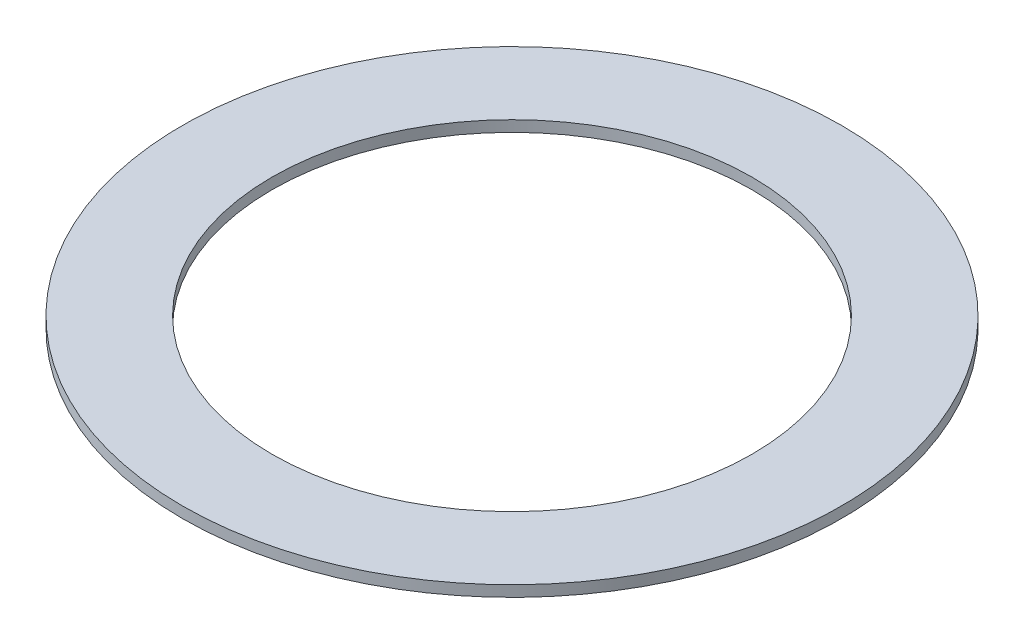
ISO-10303-21;
HEADER;
FILE_DESCRIPTION(('STEP AP214'),'2;1');
FILE_NAME('part.step','',(''),(''),'','','');
FILE_SCHEMA(('AUTOMOTIVE_DESIGN { 1 0 10303 214 1 1 1 1 }'));
ENDSEC;
DATA;
#1=APPLICATION_CONTEXT('core data for automotive mechanical design processes');
#2=APPLICATION_PROTOCOL_DEFINITION('international standard','automotive_design',2000,#1);
#3=PRODUCT_CONTEXT('',#1,'mechanical');
#4=PRODUCT('Part','Part','',(#3));
#5=PRODUCT_RELATED_PRODUCT_CATEGORY('part','',(#4));
#6=PRODUCT_DEFINITION_FORMATION('','',#4);
#7=PRODUCT_DEFINITION_CONTEXT('part definition',#1,'design');
#8=PRODUCT_DEFINITION('design','',#6,#7);
#9=PRODUCT_DEFINITION_SHAPE('','',#8);
#10=(LENGTH_UNIT() NAMED_UNIT(*) SI_UNIT(.MILLI.,.METRE.));
#11=(NAMED_UNIT(*) PLANE_ANGLE_UNIT() SI_UNIT($,.RADIAN.));
#12=(NAMED_UNIT(*) SI_UNIT($,.STERADIAN.) SOLID_ANGLE_UNIT());
#13=UNCERTAINTY_MEASURE_WITH_UNIT(LENGTH_MEASURE(1.E-05),#10,'distance_accuracy_value','');
#14=(GEOMETRIC_REPRESENTATION_CONTEXT(3) GLOBAL_UNCERTAINTY_ASSIGNED_CONTEXT((#13)) GLOBAL_UNIT_ASSIGNED_CONTEXT((#10,
#11,#12)) REPRESENTATION_CONTEXT('',''));
#15=CARTESIAN_POINT('',(0.,0.,0.));
#16=DIRECTION('',(0.,0.,1.));
#17=DIRECTION('',(1.,0.,0.));
#18=AXIS2_PLACEMENT_3D('',#15,#16,#17);
#19=CARTESIAN_POINT('',(0.,1.,0.));
#20=DIRECTION('',(0.,1.,0.));
#21=DIRECTION('',(0.,0.,1.));
#22=AXIS2_PLACEMENT_3D('',#19,#20,#21);
#23=PLANE('',#22);
#24=CARTESIAN_POINT('',(0.,1.,0.));
#25=DIRECTION('',(0.,1.,0.));
#26=DIRECTION('',(0.,0.,1.));
#27=AXIS2_PLACEMENT_3D('',#24,#25,#26);
#28=CIRCLE('',#27,30.);
#29=CARTESIAN_POINT('',(0.,1.,30.));
#30=VERTEX_POINT('',#29);
#31=EDGE_CURVE('E10',#30,#30,#28,.T.);
#32=ORIENTED_EDGE('',*,*,#31,.T.);
#33=EDGE_LOOP('',(#32));
#34=FACE_BOUND('',#33,.T.);
#35=CARTESIAN_POINT('',(0.,1.,0.));
#36=DIRECTION('',(0.,1.,0.));
#37=DIRECTION('',(0.,0.,1.));
#38=AXIS2_PLACEMENT_3D('',#35,#36,#37);
#39=CIRCLE('',#38,21.85);
#40=CARTESIAN_POINT('',(0.,1.,21.85));
#41=VERTEX_POINT('',#40);
#42=EDGE_CURVE('E50',#41,#41,#39,.T.);
#43=ORIENTED_EDGE('',*,*,#42,.F.);
#44=EDGE_LOOP('',(#43));
#45=FACE_BOUND('',#44,.T.);
#46=ADVANCED_FACE('F37',(#34,#45),#23,.T.);
#47=CARTESIAN_POINT('',(0.,0.,0.));
#48=DIRECTION('',(0.,1.,0.));
#49=DIRECTION('',(0.,0.,1.));
#50=AXIS2_PLACEMENT_3D('',#47,#48,#49);
#51=PLANE('',#50);
#52=CARTESIAN_POINT('',(0.,0.,0.));
#53=DIRECTION('',(0.,1.,0.));
#54=DIRECTION('',(0.,0.,1.));
#55=AXIS2_PLACEMENT_3D('',#52,#53,#54);
#56=CIRCLE('',#55,30.);
#57=CARTESIAN_POINT('',(0.,0.,30.));
#58=VERTEX_POINT('',#57);
#59=EDGE_CURVE('E41',#58,#58,#56,.T.);
#60=ORIENTED_EDGE('',*,*,#59,.F.);
#61=EDGE_LOOP('',(#60));
#62=FACE_BOUND('',#61,.T.);
#63=CARTESIAN_POINT('',(0.,0.,0.));
#64=DIRECTION('',(0.,1.,0.));
#65=DIRECTION('',(0.,0.,1.));
#66=AXIS2_PLACEMENT_3D('',#63,#64,#65);
#67=CIRCLE('',#66,21.85);
#68=CARTESIAN_POINT('',(0.,0.,21.85));
#69=VERTEX_POINT('',#68);
#70=EDGE_CURVE('E52',#69,#69,#67,.T.);
#71=ORIENTED_EDGE('',*,*,#70,.T.);
#72=EDGE_LOOP('',(#71));
#73=FACE_BOUND('',#72,.T.);
#74=ADVANCED_FACE('F64',(#62,#73),#51,.F.);
#75=CARTESIAN_POINT('',(0.,1.,0.));
#76=DIRECTION('',(0.,-1.,0.));
#77=DIRECTION('',(0.,0.,-1.));
#78=AXIS2_PLACEMENT_3D('',#75,#76,#77);
#79=CYLINDRICAL_SURFACE('',#78,30.);
#80=ORIENTED_EDGE('',*,*,#31,.F.);
#81=EDGE_LOOP('',(#80));
#82=FACE_BOUND('',#81,.T.);
#83=ORIENTED_EDGE('',*,*,#59,.T.);
#84=EDGE_LOOP('',(#83));
#85=FACE_BOUND('',#84,.T.);
#86=ADVANCED_FACE('F39',(#82,#85),#79,.T.);
#87=CARTESIAN_POINT('',(0.,1.,0.));
#88=DIRECTION('',(0.,-1.,0.));
#89=DIRECTION('',(0.,0.,-1.));
#90=AXIS2_PLACEMENT_3D('',#87,#88,#89);
#91=CYLINDRICAL_SURFACE('',#90,21.85);
#92=ORIENTED_EDGE('',*,*,#42,.T.);
#93=EDGE_LOOP('',(#92));
#94=FACE_BOUND('',#93,.T.);
#95=ORIENTED_EDGE('',*,*,#70,.F.);
#96=EDGE_LOOP('',(#95));
#97=FACE_BOUND('',#96,.T.);
#98=ADVANCED_FACE('F60',(#94,#97),#91,.F.);
#99=CLOSED_SHELL('',(#46,#74,#86,#98));
#100=MANIFOLD_SOLID_BREP('B2',#99);
#101=ADVANCED_BREP_SHAPE_REPRESENTATION('',(#18,#100),#14);
#102=SHAPE_DEFINITION_REPRESENTATION(#9,#101);
ENDSEC;
END-ISO-10303-21;
